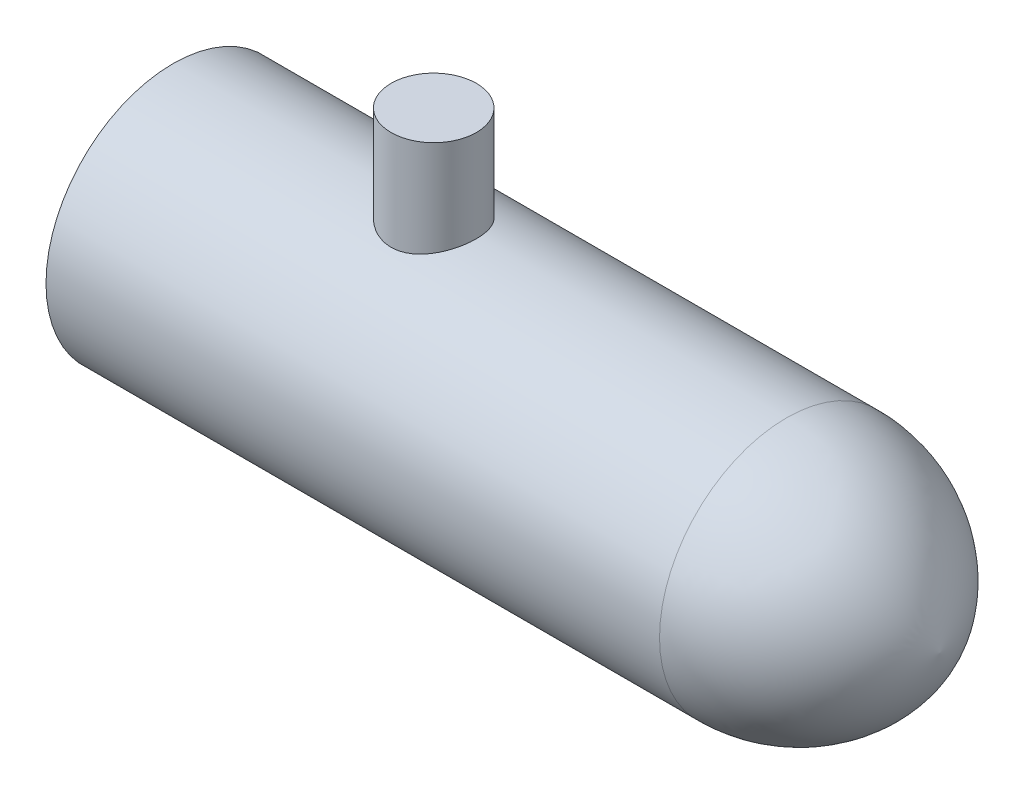
ISO-10303-21;
HEADER;
FILE_DESCRIPTION(('STEP AP214'),'2;1');
FILE_NAME('part.step','',(''),(''),'','','');
FILE_SCHEMA(('AUTOMOTIVE_DESIGN { 1 0 10303 214 1 1 1 1 }'));
ENDSEC;
DATA;
#1=APPLICATION_CONTEXT('core data for automotive mechanical design processes');
#2=APPLICATION_PROTOCOL_DEFINITION('international standard','automotive_design',2000,#1);
#3=PRODUCT_CONTEXT('',#1,'mechanical');
#4=PRODUCT('Part','Part','',(#3));
#5=PRODUCT_RELATED_PRODUCT_CATEGORY('part','',(#4));
#6=PRODUCT_DEFINITION_FORMATION('','',#4);
#7=PRODUCT_DEFINITION_CONTEXT('part definition',#1,'design');
#8=PRODUCT_DEFINITION('design','',#6,#7);
#9=PRODUCT_DEFINITION_SHAPE('','',#8);
#10=(LENGTH_UNIT() NAMED_UNIT(*) SI_UNIT(.MILLI.,.METRE.));
#11=(NAMED_UNIT(*) PLANE_ANGLE_UNIT() SI_UNIT($,.RADIAN.));
#12=(NAMED_UNIT(*) SI_UNIT($,.STERADIAN.) SOLID_ANGLE_UNIT());
#13=UNCERTAINTY_MEASURE_WITH_UNIT(LENGTH_MEASURE(1.E-05),#10,'distance_accuracy_value','');
#14=(GEOMETRIC_REPRESENTATION_CONTEXT(3) GLOBAL_UNCERTAINTY_ASSIGNED_CONTEXT((#13)) GLOBAL_UNIT_ASSIGNED_CONTEXT((#10,
#11,#12)) REPRESENTATION_CONTEXT('',''));
#15=CARTESIAN_POINT('',(0.,0.,0.));
#16=DIRECTION('',(0.,0.,1.));
#17=DIRECTION('',(1.,0.,0.));
#18=AXIS2_PLACEMENT_3D('',#15,#16,#17);
#19=CARTESIAN_POINT('',(127.,0.,0.));
#20=DIRECTION('',(-1.,0.,0.));
#21=DIRECTION('',(0.,0.,1.));
#22=AXIS2_PLACEMENT_3D('',#19,#20,#21);
#23=CYLINDRICAL_SURFACE('',#22,52.5526);
#24=CARTESIAN_POINT('',(-127.,0.,0.));
#25=DIRECTION('',(1.,0.,0.));
#26=DIRECTION('',(0.,0.,-1.));
#27=AXIS2_PLACEMENT_3D('',#24,#25,#26);
#28=CIRCLE('',#27,52.5526);
#29=CARTESIAN_POINT('',(-127.,0.,-52.5526));
#30=VERTEX_POINT('',#29);
#31=EDGE_CURVE('E67',#30,#30,#28,.T.);
#32=ORIENTED_EDGE('',*,*,#31,.T.);
#33=EDGE_LOOP('',(#32));
#34=FACE_BOUND('',#33,.T.);
#35=CARTESIAN_POINT('',(127.,0.,0.));
#36=DIRECTION('',(1.,0.,0.));
#37=DIRECTION('',(0.,0.,-1.));
#38=AXIS2_PLACEMENT_3D('',#35,#36,#37);
#39=CIRCLE('',#38,52.5526);
#40=CARTESIAN_POINT('',(127.,0.,-52.5526));
#41=VERTEX_POINT('',#40);
#42=EDGE_CURVE('E43',#41,#41,#39,.T.);
#43=ORIENTED_EDGE('',*,*,#42,.F.);
#44=EDGE_LOOP('',(#43));
#45=FACE_BOUND('',#44,.T.);
#46=CARTESIAN_POINT('',(-19.05,49.4989631988388,-17.653));
#47=CARTESIAN_POINT('',(-19.5305260048228,49.4989629532324,-17.6530003082304));
#48=CARTESIAN_POINT('',(-20.0110474586586,49.5059794142483,-17.6333633960385));
#49=CARTESIAN_POINT('',(-20.9684821638935,49.5338162332793,-17.5550145880757));
#50=CARTESIAN_POINT('',(-21.4453954572483,49.5546364305336,-17.4963031473733));
#51=CARTESIAN_POINT('',(-22.3921661941269,49.6094147409097,-17.3403732483805));
#52=CARTESIAN_POINT('',(-22.8620227875716,49.6433744238885,-17.2431501888318));
#53=CARTESIAN_POINT('',(-23.7912995671936,49.7233642483415,-17.0111095856218));
#54=CARTESIAN_POINT('',(-24.2507196509257,49.7693945082454,-16.8762916731));
#55=CARTESIAN_POINT('',(-25.1551030493514,49.8720178528158,-16.5705618405421));
#56=CARTESIAN_POINT('',(-25.6000938737013,49.9285892577525,-16.3997239088519));
#57=CARTESIAN_POINT('',(-26.4737745049151,50.0507007402627,-16.0231790848202));
#58=CARTESIAN_POINT('',(-26.9024643654421,50.116240788308,-15.8174723072796));
#59=CARTESIAN_POINT('',(-27.7410381403015,50.2544566606239,-15.372688975609));
#60=CARTESIAN_POINT('',(-28.1509191440249,50.3271335838751,-15.1336072798026));
#61=CARTESIAN_POINT('',(-28.9494721893862,50.477649546087,-14.6237240047705));
#62=CARTESIAN_POINT('',(-29.3381429208039,50.5554889032896,-14.3529204692383));
#63=CARTESIAN_POINT('',(-30.105689106652,50.7171550755363,-13.7709974847895));
#64=CARTESIAN_POINT('',(-30.4837053213106,50.8010965881028,-13.4587760333103));
#65=CARTESIAN_POINT('',(-31.2123521024094,50.9700356497915,-12.8041200380869));
#66=CARTESIAN_POINT('',(-31.5629820891438,51.055033221224,-12.4616848551115));
#67=CARTESIAN_POINT('',(-32.2347668620751,51.2238195890739,-11.748629782362));
#68=CARTESIAN_POINT('',(-32.5559164399133,51.3076081697011,-11.3780049333358));
#69=CARTESIAN_POINT('',(-33.166598905442,51.4717320940753,-10.6108622952378));
#70=CARTESIAN_POINT('',(-33.4561327432055,51.552067541547,-10.2143452848142));
#71=CARTESIAN_POINT('',(-34.0088870602722,51.7092212805486,-9.38691533446949));
#72=CARTESIAN_POINT('',(-34.2712013772305,51.7858889187284,-8.95536758787141));
#73=CARTESIAN_POINT('',(-34.7583930256163,51.9311744843795,-8.07031378102594));
#74=CARTESIAN_POINT('',(-34.9832694983149,51.9997922271961,-7.61680721740708));
#75=CARTESIAN_POINT('',(-35.3936366556601,52.1269963633454,-6.69105653530741));
#76=CARTESIAN_POINT('',(-35.5791356845668,52.1855848814061,-6.21881641177716));
#77=CARTESIAN_POINT('',(-35.9091060056045,52.2910350591554,-5.25894263959737));
#78=CARTESIAN_POINT('',(-36.0535790839836,52.3378972293924,-4.77130966217203));
#79=CARTESIAN_POINT('',(-36.2957404579975,52.4170802315864,-3.80179177378046));
#80=CARTESIAN_POINT('',(-36.3948997345633,52.4498558261846,-3.32031120238063));
#81=CARTESIAN_POINT('',(-36.5527770729487,52.5022761670325,-2.3500553748456));
#82=CARTESIAN_POINT('',(-36.6114960009825,52.5219211945329,-1.86128027518505));
#83=CARTESIAN_POINT('',(-36.6878996032651,52.5475171877741,-0.880285902860969));
#84=CARTESIAN_POINT('',(-36.7055935077917,52.5534712338656,-0.388067429929154));
#85=CARTESIAN_POINT('',(-36.6997936331135,52.5515229015678,0.596093465590439));
#86=CARTESIAN_POINT('',(-36.676300824031,52.5436208495485,1.08803589440721));
#87=CARTESIAN_POINT('',(-36.5901262788203,52.5147772968123,2.04827139178186));
#88=CARTESIAN_POINT('',(-36.5290448840084,52.4943684179944,2.51672515757799));
#89=CARTESIAN_POINT('',(-36.3697032119262,52.4415277285783,3.44655975563729));
#90=CARTESIAN_POINT('',(-36.2714441011002,52.4090962951862,3.90794080933304));
#91=CARTESIAN_POINT('',(-36.0386096296896,52.3330499850577,4.82051035603774));
#92=CARTESIAN_POINT('',(-35.9040329213144,52.2894346932775,5.27169847010062));
#93=CARTESIAN_POINT('',(-35.5996906935615,52.1921339319114,6.16092522971633));
#94=CARTESIAN_POINT('',(-35.429924384959,52.1384482364712,6.59896358009681));
#95=CARTESIAN_POINT('',(-35.054069474846,52.0215848095426,7.46484160145619));
#96=CARTESIAN_POINT('',(-34.8475305644515,51.9582910271362,7.89247002884542));
#97=CARTESIAN_POINT('',(-34.4012494717337,51.8243468694953,8.72881566924354));
#98=CARTESIAN_POINT('',(-34.1615071654825,51.7536964668033,9.13753281166059));
#99=CARTESIAN_POINT('',(-33.6504292948141,51.6067824374806,9.93376677166329));
#100=CARTESIAN_POINT('',(-33.3790868818001,51.5305175953716,10.3212789667157));
#101=CARTESIAN_POINT('',(-32.8065910408146,51.3742672079718,11.072840123111));
#102=CARTESIAN_POINT('',(-32.5054358712761,51.2942814454615,11.4368877116723));
#103=CARTESIAN_POINT('',(-31.8600697664396,51.1286945292606,12.1562756413503));
#104=CARTESIAN_POINT('',(-31.5144890371448,51.043007688898,12.5103685350521));
#105=CARTESIAN_POINT('',(-30.7947776857458,50.8720453028093,13.1883676350565));
#106=CARTESIAN_POINT('',(-30.4206461496407,50.7867697703435,13.5122728742194));
#107=CARTESIAN_POINT('',(-29.6460550877503,50.6189765870499,14.1278731592793));
#108=CARTESIAN_POINT('',(-29.2455907077052,50.5364594489639,14.4195622396656));
#109=CARTESIAN_POINT('',(-28.4208603148094,50.376549804956,14.9686604079249));
#110=CARTESIAN_POINT('',(-27.9965953481441,50.2991570741098,15.2260710008773));
#111=CARTESIAN_POINT('',(-27.1204628721498,50.1506794767551,15.7082694432515));
#112=CARTESIAN_POINT('',(-26.6682802770921,50.0797046328007,15.9325194311845));
#113=CARTESIAN_POINT('',(-25.7451373823873,49.9476084178934,16.341924187645));
#114=CARTESIAN_POINT('',(-25.2741767929538,49.8864871990775,16.5270783525588));
#115=CARTESIAN_POINT('',(-24.3169982366921,49.776126325458,16.8565483599118));
#116=CARTESIAN_POINT('',(-23.8307856778713,49.7268825118225,17.0008784998068));
#117=CARTESIAN_POINT('',(-22.8466282890408,49.6419328248548,17.2473565736121));
#118=CARTESIAN_POINT('',(-22.348684076878,49.6062262402705,17.3495067237036));
#119=CARTESIAN_POINT('',(-21.3679931030143,49.5509014474553,17.5068716337016));
#120=CARTESIAN_POINT('',(-20.8855932286939,49.5306219564494,17.564019809731));
#121=CARTESIAN_POINT('',(-19.9173421141814,49.5041966202527,17.6383632989964));
#122=CARTESIAN_POINT('',(-19.4314909795848,49.4980503444914,17.6555598293653));
#123=CARTESIAN_POINT('',(-18.4601396769927,49.5000953392603,17.6498252870763));
#124=CARTESIAN_POINT('',(-17.9746394642282,49.5082842377191,17.6269008533189));
#125=CARTESIAN_POINT('',(-17.0076248872328,49.5387233225306,17.5411721735903));
#126=CARTESIAN_POINT('',(-16.526110472625,49.560973330888,17.4783684324388));
#127=CARTESIAN_POINT('',(-15.5874809088415,49.6177857023735,17.3164133050624));
#128=CARTESIAN_POINT('',(-15.1301030240024,49.6518878301719,17.2186170331622));
#129=CARTESIAN_POINT('',(-14.2254897064702,49.731481450321,16.9873616475416));
#130=CARTESIAN_POINT('',(-13.7782539810417,49.77697261349,16.8539035645607));
#131=CARTESIAN_POINT('',(-12.8967123773343,49.8780364163562,16.5524168298574));
#132=CARTESIAN_POINT('',(-12.4624081985055,49.9336103743756,16.3843836570673));
#133=CARTESIAN_POINT('',(-11.6094012494533,50.0532865731965,16.0150531565084));
#134=CARTESIAN_POINT('',(-11.1906990034913,50.1173891002477,15.8137547121819));
#135=CARTESIAN_POINT('',(-10.3581543440956,50.2545677270926,15.3723543998797));
#136=CARTESIAN_POINT('',(-9.94489853217033,50.3278656989315,15.1312150424022));
#137=CARTESIAN_POINT('',(-9.13998388506491,50.4796941749533,14.6167082349323));
#138=CARTESIAN_POINT('',(-8.74832539415971,50.5582247625034,14.3433402714134));
#139=CARTESIAN_POINT('',(-7.9887344047771,50.7184489836257,13.7660606823625));
#140=CARTESIAN_POINT('',(-7.6208080752419,50.8001434308508,13.4621411673618));
#141=CARTESIAN_POINT('',(-6.91087534894005,50.9645605547226,12.8256523836894));
#142=CARTESIAN_POINT('',(-6.56886956701282,51.0472832557056,12.4930824358245));
#143=CARTESIAN_POINT('',(-5.89666196779213,51.2156873633086,11.784236347831));
#144=CARTESIAN_POINT('',(-5.56786164980434,51.3013149078072,11.4066166274879));
#145=CARTESIAN_POINT('',(-4.943162141852,51.4690166050539,10.6243168020338));
#146=CARTESIAN_POINT('',(-4.64726409683638,51.5510906340844,10.2196357560139));
#147=CARTESIAN_POINT('',(-4.09048600451773,51.7094107699158,9.38576954193084));
#148=CARTESIAN_POINT('',(-3.82960585349636,51.7856568939778,8.95658444645064));
#149=CARTESIAN_POINT('',(-3.34487805322687,51.9301903844258,8.07650365774247));
#150=CARTESIAN_POINT('',(-3.12102960281029,51.9984779229837,7.62560843447838));
#151=CARTESIAN_POINT('',(-2.71355141181284,52.1247504748816,6.70814140383632));
#152=CARTESIAN_POINT('',(-2.52967094679409,52.1827992566682,6.24168982961206));
#153=CARTESIAN_POINT('',(-2.20194279661229,52.2874770539158,5.29366602232385));
#154=CARTESIAN_POINT('',(-2.05809516401553,52.3341060543817,4.81209376940616));
#155=CARTESIAN_POINT('',(-1.81184474542851,52.4145762528024,3.83756646924434));
#156=CARTESIAN_POINT('',(-1.70942936716601,52.4484213358937,3.34461492866244));
#157=CARTESIAN_POINT('',(-1.54701722723492,52.502341619747,2.35103447011388));
#158=CARTESIAN_POINT('',(-1.48701860490198,52.5224174245146,1.8504058898946));
#159=CARTESIAN_POINT('',(-1.41189596467533,52.5475870533606,0.869483097616853));
#160=CARTESIAN_POINT('',(-1.39476723498748,52.5533500757475,0.389358507138945));
#161=CARTESIAN_POINT('',(-1.39969825714713,52.5516935612094,-0.570656921693795));
#162=CARTESIAN_POINT('',(-1.42175668223769,52.5442744705903,-1.05054776741227));
#163=CARTESIAN_POINT('',(-1.5048444310666,52.5164575861785,-2.00651728905968));
#164=CARTESIAN_POINT('',(-1.56587052419689,52.4960608682944,-2.48259627769737));
#165=CARTESIAN_POINT('',(-1.72631370669081,52.4428426406368,-3.42753040314198));
#166=CARTESIAN_POINT('',(-1.82573088887569,52.4100211008229,-3.89638552248031));
#167=CARTESIAN_POINT('',(-2.060108966688,52.3334664361127,-4.81595874250626));
#168=CARTESIAN_POINT('',(-2.19446028775054,52.2899210636899,-5.26684818122525));
#169=CARTESIAN_POINT('',(-2.49829888194531,52.1927721009386,-6.15549378992734));
#170=CARTESIAN_POINT('',(-2.66778557644833,52.1391686762531,-6.59325017605708));
#171=CARTESIAN_POINT('',(-3.04059024408549,52.0232369609472,-7.45297063350527));
#172=CARTESIAN_POINT('',(-3.2439127047247,51.9609075132029,-7.87493260096695));
#173=CARTESIAN_POINT('',(-3.68289081202383,51.8290612218567,-8.70051481434604));
#174=CARTESIAN_POINT('',(-3.91854749337005,51.7595441482704,-9.1041344727641));
#175=CARTESIAN_POINT('',(-4.42996828882149,51.6123096830446,-9.90541905669726));
#176=CARTESIAN_POINT('',(-4.7069006500743,51.5343831236761,-10.3023001478605));
#177=CARTESIAN_POINT('',(-5.29196656130133,51.374620831495,-11.0715149537279));
#178=CARTESIAN_POINT('',(-5.60010078862073,51.2927850138388,-11.4438481352444));
#179=CARTESIAN_POINT('',(-6.24571532706285,51.1272892024678,-12.1619025325651));
#180=CARTESIAN_POINT('',(-6.58320421625972,51.0436286809221,-12.5076159134648));
#181=CARTESIAN_POINT('',(-7.28542006291579,50.8766784240879,-13.1702747062203));
#182=CARTESIAN_POINT('',(-7.6501473703436,50.793388693578,-13.4872197483345));
#183=CARTESIAN_POINT('',(-8.41981629606579,50.6260952244112,-14.102479541039));
#184=CARTESIAN_POINT('',(-8.82578285790284,50.5421961538599,-14.3995422277025));
#185=CARTESIAN_POINT('',(-9.66233574248843,50.3796316292146,-14.9583824940466));
#186=CARTESIAN_POINT('',(-10.0929229290308,50.3009663589538,-15.2201588346524));
#187=CARTESIAN_POINT('',(-10.9758569848995,50.1512704933782,-15.7063860482266));
#188=CARTESIAN_POINT('',(-11.428199795944,50.0802384820941,-15.9308438480248));
#189=CARTESIAN_POINT('',(-12.3516658031489,49.9480359221968,-16.340620121607));
#190=CARTESIAN_POINT('',(-12.8227880635384,49.8868648829803,-16.5259405426969));
#191=CARTESIAN_POINT('',(-13.7612872147314,49.7786035104617,-16.8491628162279));
#192=CARTESIAN_POINT('',(-14.2280590296425,49.7310475264053,-16.9886659495384));
#193=CARTESIAN_POINT('',(-15.1725814828251,49.6483682826003,-17.2287971432793));
#194=CARTESIAN_POINT('',(-15.6503317876854,49.6132446458175,-17.3294263826421));
#195=CARTESIAN_POINT('',(-16.6131739276796,49.5565798802893,-17.4908115615436));
#196=CARTESIAN_POINT('',(-17.0982634829024,49.5350346187171,-17.5515796337877));
#197=CARTESIAN_POINT('',(-18.0722369540079,49.5062264735932,-17.63267349613));
#198=CARTESIAN_POINT('',(-18.5611208322966,49.4989634487148,-17.6529996864116));
#199=CARTESIAN_POINT('',(-19.05,49.4989631988388,-17.653));
#200=B_SPLINE_CURVE_WITH_KNOTS('',3,(#46,#47,#48,#49,#50,#51,#52,#53,#54,#55,#56,#57,#58,#59,
#60,#61,#62,#63,#64,#65,#66,#67,#68,#69,#70,#71,#72,#73,#74,#75,#76,#77,#78,#79,#80,#81,#82,#83,
#84,#85,#86,#87,#88,#89,#90,#91,#92,#93,#94,#95,#96,#97,#98,#99,#100,#101,#102,#103,#104,#105,
#106,#107,#108,#109,#110,#111,#112,#113,#114,#115,#116,#117,#118,#119,#120,#121,#122,#123,#124,
#125,#126,#127,#128,#129,#130,#131,#132,#133,#134,#135,#136,#137,#138,#139,#140,#141,#142,#143,
#144,#145,#146,#147,#148,#149,#150,#151,#152,#153,#154,#155,#156,#157,#158,#159,#160,#161,#162,
#163,#164,#165,#166,#167,#168,#169,#170,#171,#172,#173,#174,#175,#176,#177,#178,#179,#180,#181,
#182,#183,#184,#185,#186,#187,#188,#189,#190,#191,#192,#193,#194,#195,#196,#197,#198,#199),
.UNSPECIFIED.,.T.,.F.,(4,2,2,2,2,2,2,2,2,2,2,2,2,2,2,2,2,2,2,2,2,2,2,2,2,2,2,2,2,2,2,2,2,2,2,2,
2,2,2,2,2,2,2,2,2,2,2,2,2,2,2,2,2,2,2,2,2,2,2,2,2,2,2,2,2,2,2,2,2,2,2,2,2,2,2,2,4),(0.,
1.44112031493301,2.88222384663087,4.323499609217,5.76478951331909,7.20314722912156,
8.64150020941933,10.0800750246856,11.5187386045467,13.0093041356322,14.4999012101472,
15.9907611264231,17.4815762290829,19.012095763362,20.5426503990297,22.0728803787096,
23.6030437227701,25.0792130214696,26.5553507003022,28.0311562286009,29.5069269958658,
30.9238395826856,32.3407077178116,33.7576284418845,35.174580947788,36.6102565730068,
38.0459375568682,39.4819302726655,40.9180069241776,42.4227099010095,43.9274610683369,
45.4324904070134,46.9374536419516,48.4646402715415,49.9918504781638,51.5185251586343,
53.0451196157959,54.5018752734425,55.958586550221,57.4150568047079,58.8715086225622,
60.2767697618632,61.6819902890491,63.0873946809555,64.4928462552243,65.9433758788825,
67.393928618217,68.8448569074864,70.295819602236,71.8179418521375,73.340117053007,
74.8622877452963,76.3844255016243,77.8967199254094,79.409016334948,80.920852774814,
82.4326228919576,83.8722542570748,85.3118368816163,86.7513001732925,88.1907669452979,
89.606629488523,91.0224687163745,92.438495871305,93.8545683492932,95.323467037555,
96.792397620218,98.2617589080103,99.7311390779138,101.259285775388,102.787486119536,
104.315402491426,105.843242822913,107.309920274496,108.776553242522,110.242739598119,
111.708911445332),.UNSPECIFIED.);
#201=CARTESIAN_POINT('',(-19.05,49.4989631988388,-17.653));
#202=VERTEX_POINT('',#201);
#203=EDGE_CURVE('E11',#202,#202,#200,.T.);
#204=ORIENTED_EDGE('',*,*,#203,.F.);
#205=EDGE_LOOP('',(#204));
#206=FACE_BOUND('',#205,.T.);
#207=ADVANCED_FACE('F32',(#34,#45,#206),#23,.T.);
#208=CARTESIAN_POINT('',(-127.,0.,0.));
#209=DIRECTION('',(1.,0.,0.));
#210=DIRECTION('',(0.,0.,-1.));
#211=AXIS2_PLACEMENT_3D('',#208,#209,#210);
#212=PLANE('',#211);
#213=ORIENTED_EDGE('',*,*,#31,.F.);
#214=EDGE_LOOP('',(#213));
#215=FACE_BOUND('',#214,.T.);
#216=ADVANCED_FACE('F49',(#215),#212,.F.);
#217=CARTESIAN_POINT('',(127.,0.,-12.0876439342678));
#218=DIRECTION('',(0.,-1.,0.));
#219=DIRECTION('',(0.,0.,1.));
#220=AXIS2_PLACEMENT_3D('',#217,#218,#219);
#221=CIRCLE('',#220,64.6402439342678);
#222=TRIMMED_CURVE('',#221,(PARAMETER_VALUE(-1.38269023004621)),
(PARAMETER_VALUE(1.38269023004621)),.T.,.PARAMETER.);
#223=CARTESIAN_POINT('',(127.,0.,0.));
#224=DIRECTION('',(-1.,0.,0.));
#225=AXIS1_PLACEMENT('',#223,#224);
#226=SURFACE_OF_REVOLUTION('',#222,#225);
#227=ORIENTED_EDGE('',*,*,#42,.T.);
#228=EDGE_LOOP('',(#227));
#229=FACE_BOUND('',#228,.T.);
#230=CARTESIAN_POINT('',(190.5,0.,0.));
#231=VERTEX_POINT('',#230);
#232=VERTEX_LOOP('',#231);
#233=FACE_BOUND('',#232,.T.);
#234=ADVANCED_FACE('F46',(#229,#233),#226,.T.);
#235=CARTESIAN_POINT('',(-19.05,90.6526,0.));
#236=DIRECTION('',(0.,-1.,0.));
#237=DIRECTION('',(0.,0.,-1.));
#238=AXIS2_PLACEMENT_3D('',#235,#236,#237);
#239=CYLINDRICAL_SURFACE('',#238,17.653);
#240=CARTESIAN_POINT('',(-19.05,90.6526,0.));
#241=DIRECTION('',(0.,1.,0.));
#242=DIRECTION('',(0.,0.,1.));
#243=AXIS2_PLACEMENT_3D('',#240,#241,#242);
#244=CIRCLE('',#243,17.653);
#245=CARTESIAN_POINT('',(-19.05,90.6526,17.653));
#246=VERTEX_POINT('',#245);
#247=EDGE_CURVE('E73',#246,#246,#244,.T.);
#248=ORIENTED_EDGE('',*,*,#247,.F.);
#249=EDGE_LOOP('',(#248));
#250=FACE_BOUND('',#249,.T.);
#251=ORIENTED_EDGE('',*,*,#203,.T.);
#252=EDGE_LOOP('',(#251));
#253=FACE_BOUND('',#252,.T.);
#254=ADVANCED_FACE('F48',(#250,#253),#239,.T.);
#255=CARTESIAN_POINT('',(-19.05,90.6526,0.));
#256=DIRECTION('',(0.,1.,0.));
#257=DIRECTION('',(0.,0.,1.));
#258=AXIS2_PLACEMENT_3D('',#255,#256,#257);
#259=PLANE('',#258);
#260=ORIENTED_EDGE('',*,*,#247,.T.);
#261=EDGE_LOOP('',(#260));
#262=FACE_BOUND('',#261,.T.);
#263=ADVANCED_FACE('F56',(#262),#259,.T.);
#264=CLOSED_SHELL('',(#207,#216,#234,#254,#263));
#265=MANIFOLD_SOLID_BREP('B2',#264);
#266=ADVANCED_BREP_SHAPE_REPRESENTATION('',(#18,#265),#14);
#267=SHAPE_DEFINITION_REPRESENTATION(#9,#266);
ENDSEC;
END-ISO-10303-21;
